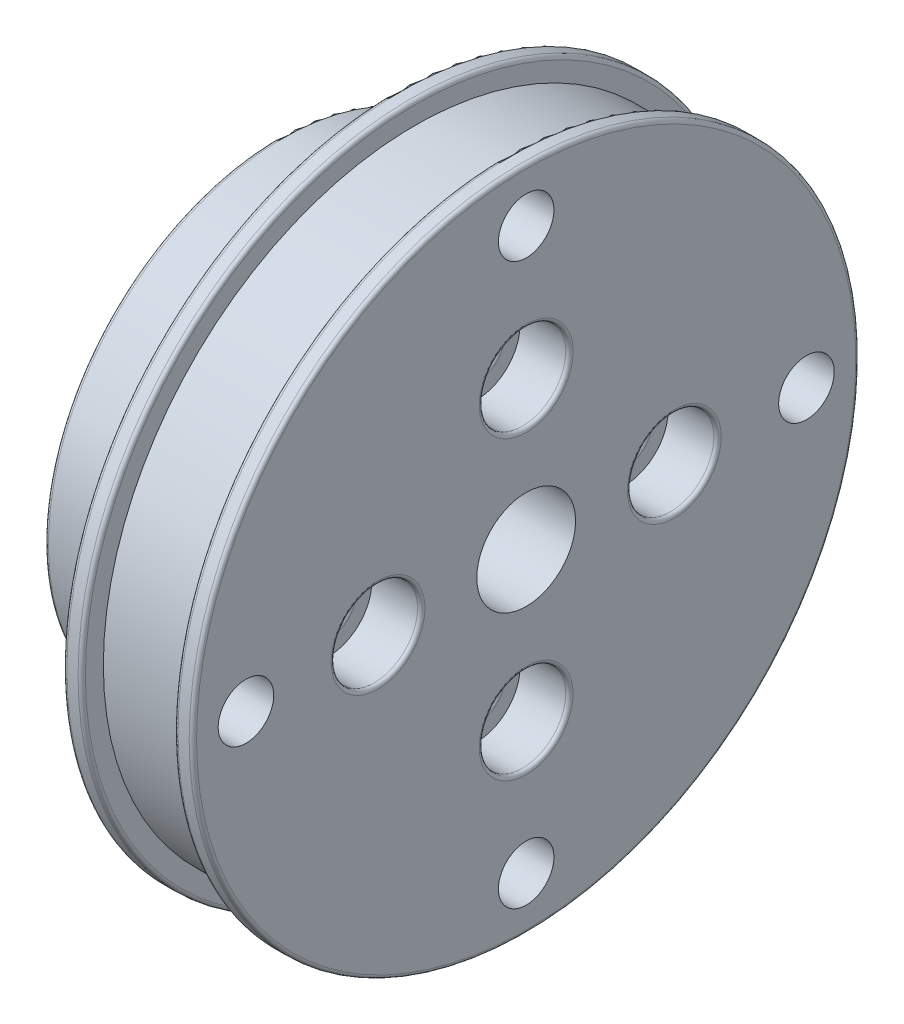
ISO-10303-21;
HEADER;
FILE_DESCRIPTION(('STEP AP214'),'2;1');
FILE_NAME('part.step','',(''),(''),'','','');
FILE_SCHEMA(('AUTOMOTIVE_DESIGN { 1 0 10303 214 1 1 1 1 }'));
ENDSEC;
DATA;
#1=APPLICATION_CONTEXT('core data for automotive mechanical design processes');
#2=APPLICATION_PROTOCOL_DEFINITION('international standard','automotive_design',2000,#1);
#3=PRODUCT_CONTEXT('',#1,'mechanical');
#4=PRODUCT('Part','Part','',(#3));
#5=PRODUCT_RELATED_PRODUCT_CATEGORY('part','',(#4));
#6=PRODUCT_DEFINITION_FORMATION('','',#4);
#7=PRODUCT_DEFINITION_CONTEXT('part definition',#1,'design');
#8=PRODUCT_DEFINITION('design','',#6,#7);
#9=PRODUCT_DEFINITION_SHAPE('','',#8);
#10=(LENGTH_UNIT() NAMED_UNIT(*) SI_UNIT(.MILLI.,.METRE.));
#11=(NAMED_UNIT(*) PLANE_ANGLE_UNIT() SI_UNIT($,.RADIAN.));
#12=(NAMED_UNIT(*) SI_UNIT($,.STERADIAN.) SOLID_ANGLE_UNIT());
#13=UNCERTAINTY_MEASURE_WITH_UNIT(LENGTH_MEASURE(1.E-05),#10,'distance_accuracy_value','');
#14=(GEOMETRIC_REPRESENTATION_CONTEXT(3) GLOBAL_UNCERTAINTY_ASSIGNED_CONTEXT((#13)) GLOBAL_UNIT_ASSIGNED_CONTEXT((#10,
#11,#12)) REPRESENTATION_CONTEXT('',''));
#15=CARTESIAN_POINT('',(0.,0.,0.));
#16=DIRECTION('',(0.,0.,1.));
#17=DIRECTION('',(1.,0.,0.));
#18=AXIS2_PLACEMENT_3D('',#15,#16,#17);
#19=CARTESIAN_POINT('',(-9.5,-12.,1.25693328198353E-13));
#20=DIRECTION('',(1.,0.,0.));
#21=DIRECTION('',(0.,0.,-1.));
#22=AXIS2_PLACEMENT_3D('',#19,#20,#21);
#23=CYLINDRICAL_SURFACE('',#22,2.);
#24=CARTESIAN_POINT('',(-9.2,-12.,1.25693328198353E-13));
#25=DIRECTION('',(1.,0.,0.));
#26=DIRECTION('',(0.,0.,-1.));
#27=AXIS2_PLACEMENT_3D('',#24,#25,#26);
#28=CIRCLE('',#27,2.);
#29=CARTESIAN_POINT('',(-9.2,-12.,-1.99999999999987));
#30=VERTEX_POINT('',#29);
#31=EDGE_CURVE('E97',#30,#30,#28,.F.);
#32=ORIENTED_EDGE('',*,*,#31,.T.);
#33=EDGE_LOOP('',(#32));
#34=FACE_BOUND('',#33,.T.);
#35=CARTESIAN_POINT('',(6.2,-12.,1.25693328198353E-13));
#36=DIRECTION('',(1.,0.,0.));
#37=DIRECTION('',(0.,0.,-1.));
#38=AXIS2_PLACEMENT_3D('',#35,#36,#37);
#39=CIRCLE('',#38,2.);
#40=CARTESIAN_POINT('',(6.2,-12.,-1.99999999999987));
#41=VERTEX_POINT('',#40);
#42=EDGE_CURVE('E100',#41,#41,#39,.T.);
#43=ORIENTED_EDGE('',*,*,#42,.T.);
#44=EDGE_LOOP('',(#43));
#45=FACE_BOUND('',#44,.T.);
#46=ADVANCED_FACE('F35',(#34,#45),#23,.F.);
#47=CARTESIAN_POINT('',(-9.5,0.,-12.));
#48=DIRECTION('',(1.,0.,0.));
#49=DIRECTION('',(0.,0.,-1.));
#50=AXIS2_PLACEMENT_3D('',#47,#48,#49);
#51=CYLINDRICAL_SURFACE('',#50,2.);
#52=CARTESIAN_POINT('',(-9.2,0.,-12.));
#53=DIRECTION('',(1.,0.,0.));
#54=DIRECTION('',(0.,0.,-1.));
#55=AXIS2_PLACEMENT_3D('',#52,#53,#54);
#56=CIRCLE('',#55,2.);
#57=CARTESIAN_POINT('',(-9.2,0.,-14.));
#58=VERTEX_POINT('',#57);
#59=EDGE_CURVE('E91',#58,#58,#56,.F.);
#60=ORIENTED_EDGE('',*,*,#59,.T.);
#61=EDGE_LOOP('',(#60));
#62=FACE_BOUND('',#61,.T.);
#63=CARTESIAN_POINT('',(6.2,0.,-12.));
#64=DIRECTION('',(1.,0.,0.));
#65=DIRECTION('',(0.,0.,-1.));
#66=AXIS2_PLACEMENT_3D('',#63,#64,#65);
#67=CIRCLE('',#66,2.);
#68=CARTESIAN_POINT('',(6.2,0.,-14.));
#69=VERTEX_POINT('',#68);
#70=EDGE_CURVE('E94',#69,#69,#67,.T.);
#71=ORIENTED_EDGE('',*,*,#70,.T.);
#72=EDGE_LOOP('',(#71));
#73=FACE_BOUND('',#72,.T.);
#74=ADVANCED_FACE('F248',(#62,#73),#51,.F.);
#75=CARTESIAN_POINT('',(-9.5,12.,0.));
#76=DIRECTION('',(1.,0.,0.));
#77=DIRECTION('',(0.,0.,-1.));
#78=AXIS2_PLACEMENT_3D('',#75,#76,#77);
#79=CYLINDRICAL_SURFACE('',#78,2.);
#80=CARTESIAN_POINT('',(-9.2,12.,0.));
#81=DIRECTION('',(1.,0.,0.));
#82=DIRECTION('',(0.,0.,-1.));
#83=AXIS2_PLACEMENT_3D('',#80,#81,#82);
#84=CIRCLE('',#83,2.);
#85=CARTESIAN_POINT('',(-9.2,12.,-2.00000000000004));
#86=VERTEX_POINT('',#85);
#87=EDGE_CURVE('E85',#86,#86,#84,.F.);
#88=ORIENTED_EDGE('',*,*,#87,.T.);
#89=EDGE_LOOP('',(#88));
#90=FACE_BOUND('',#89,.T.);
#91=CARTESIAN_POINT('',(6.2,12.,0.));
#92=DIRECTION('',(1.,0.,0.));
#93=DIRECTION('',(0.,0.,-1.));
#94=AXIS2_PLACEMENT_3D('',#91,#92,#93);
#95=CIRCLE('',#94,2.);
#96=CARTESIAN_POINT('',(6.2,12.,-2.00000000000004));
#97=VERTEX_POINT('',#96);
#98=EDGE_CURVE('E88',#97,#97,#95,.T.);
#99=ORIENTED_EDGE('',*,*,#98,.T.);
#100=EDGE_LOOP('',(#99));
#101=FACE_BOUND('',#100,.T.);
#102=ADVANCED_FACE('F254',(#90,#101),#79,.F.);
#103=CARTESIAN_POINT('',(-9.5,0.,12.));
#104=DIRECTION('',(1.,0.,0.));
#105=DIRECTION('',(0.,0.,-1.));
#106=AXIS2_PLACEMENT_3D('',#103,#104,#105);
#107=CYLINDRICAL_SURFACE('',#106,2.);
#108=CARTESIAN_POINT('',(-9.2,0.,12.));
#109=DIRECTION('',(1.,0.,0.));
#110=DIRECTION('',(0.,0.,-1.));
#111=AXIS2_PLACEMENT_3D('',#108,#109,#110);
#112=CIRCLE('',#111,2.);
#113=CARTESIAN_POINT('',(-9.2,0.,10.));
#114=VERTEX_POINT('',#113);
#115=EDGE_CURVE('E79',#114,#114,#112,.F.);
#116=ORIENTED_EDGE('',*,*,#115,.T.);
#117=EDGE_LOOP('',(#116));
#118=FACE_BOUND('',#117,.T.);
#119=CARTESIAN_POINT('',(6.2,0.,12.));
#120=DIRECTION('',(1.,0.,0.));
#121=DIRECTION('',(0.,0.,-1.));
#122=AXIS2_PLACEMENT_3D('',#119,#120,#121);
#123=CIRCLE('',#122,2.);
#124=CARTESIAN_POINT('',(6.2,0.,10.));
#125=VERTEX_POINT('',#124);
#126=EDGE_CURVE('E82',#125,#125,#123,.T.);
#127=ORIENTED_EDGE('',*,*,#126,.T.);
#128=EDGE_LOOP('',(#127));
#129=FACE_BOUND('',#128,.T.);
#130=ADVANCED_FACE('F284',(#118,#129),#107,.F.);
#131=CARTESIAN_POINT('',(0.,0.,0.));
#132=DIRECTION('',(-1.,0.,0.));
#133=DIRECTION('',(0.,0.,1.));
#134=AXIS2_PLACEMENT_3D('',#131,#132,#133);
#135=CYLINDRICAL_SURFACE('',#134,27.);
#136=CARTESIAN_POINT('',(9.3,0.,0.));
#137=DIRECTION('',(1.,0.,0.));
#138=DIRECTION('',(0.,0.,-1.));
#139=AXIS2_PLACEMENT_3D('',#136,#137,#138);
#140=CIRCLE('',#139,27.);
#141=CARTESIAN_POINT('',(9.3,0.,-27.));
#142=VERTEX_POINT('',#141);
#143=EDGE_CURVE('E136',#142,#142,#140,.T.);
#144=ORIENTED_EDGE('',*,*,#143,.T.);
#145=EDGE_LOOP('',(#144));
#146=FACE_BOUND('',#145,.T.);
#147=CARTESIAN_POINT('',(10.2,0.,0.));
#148=DIRECTION('',(-1.,0.,0.));
#149=DIRECTION('',(0.,0.,1.));
#150=AXIS2_PLACEMENT_3D('',#147,#148,#149);
#151=CIRCLE('',#150,27.);
#152=CARTESIAN_POINT('',(10.2,0.,27.));
#153=VERTEX_POINT('',#152);
#154=EDGE_CURVE('E139',#153,#153,#151,.T.);
#155=ORIENTED_EDGE('',*,*,#154,.T.);
#156=EDGE_LOOP('',(#155));
#157=FACE_BOUND('',#156,.T.);
#158=ADVANCED_FACE('F282',(#146,#157),#135,.T.);
#159=CARTESIAN_POINT('',(10.5,0.,-17.5));
#160=DIRECTION('',(-1.,0.,0.));
#161=DIRECTION('',(0.,0.,1.));
#162=AXIS2_PLACEMENT_3D('',#159,#160,#161);
#163=PLANE('',#162);
#164=CARTESIAN_POINT('',(10.5,22.7,0.));
#165=DIRECTION('',(-1.,0.,0.));
#166=DIRECTION('',(0.,0.,1.));
#167=AXIS2_PLACEMENT_3D('',#164,#165,#166);
#168=CIRCLE('',#167,2.25);
#169=CARTESIAN_POINT('',(10.5,22.7,2.25));
#170=VERTEX_POINT('',#169);
#171=EDGE_CURVE('E171',#170,#170,#168,.T.);
#172=ORIENTED_EDGE('',*,*,#171,.T.);
#173=EDGE_LOOP('',(#172));
#174=FACE_BOUND('',#173,.T.);
#175=CARTESIAN_POINT('',(10.5,6.41902997116447E-13,22.7000000000006));
#176=DIRECTION('',(-1.,0.,0.));
#177=DIRECTION('',(0.,0.,1.));
#178=AXIS2_PLACEMENT_3D('',#175,#176,#177);
#179=CIRCLE('',#178,2.2500000000005);
#180=CARTESIAN_POINT('',(10.5,6.41902997116447E-13,24.9500000000011));
#181=VERTEX_POINT('',#180);
#182=EDGE_CURVE('E194',#181,#181,#179,.T.);
#183=ORIENTED_EDGE('',*,*,#182,.T.);
#184=EDGE_LOOP('',(#183));
#185=FACE_BOUND('',#184,.T.);
#186=CARTESIAN_POINT('',(10.5,-22.7,1.28429585295255E-12));
#187=DIRECTION('',(-1.,0.,0.));
#188=DIRECTION('',(0.,0.,1.));
#189=AXIS2_PLACEMENT_3D('',#186,#187,#188);
#190=CIRCLE('',#189,2.25000000000138);
#191=CARTESIAN_POINT('',(10.5,-22.7,2.25000000000266));
#192=VERTEX_POINT('',#191);
#193=EDGE_CURVE('E188',#192,#192,#190,.T.);
#194=ORIENTED_EDGE('',*,*,#193,.T.);
#195=EDGE_LOOP('',(#194));
#196=FACE_BOUND('',#195,.T.);
#197=CARTESIAN_POINT('',(10.5,-6.44682945350512E-13,-22.6999999999994));
#198=DIRECTION('',(-1.,0.,0.));
#199=DIRECTION('',(0.,0.,1.));
#200=AXIS2_PLACEMENT_3D('',#197,#198,#199);
#201=CIRCLE('',#200,2.25000000000103);
#202=CARTESIAN_POINT('',(10.5,-6.44682945350512E-13,-20.4499999999983));
#203=VERTEX_POINT('',#202);
#204=EDGE_CURVE('E182',#203,#203,#201,.T.);
#205=ORIENTED_EDGE('',*,*,#204,.T.);
#206=EDGE_LOOP('',(#205));
#207=FACE_BOUND('',#206,.T.);
#208=CARTESIAN_POINT('',(10.5,-12.,1.25693328198353E-13));
#209=DIRECTION('',(-1.,0.,0.));
#210=DIRECTION('',(0.,0.,1.));
#211=AXIS2_PLACEMENT_3D('',#208,#209,#210);
#212=CIRCLE('',#211,3.8);
#213=CARTESIAN_POINT('',(10.5,-12.,3.80000000000013));
#214=VERTEX_POINT('',#213);
#215=EDGE_CURVE('E61',#214,#214,#212,.T.);
#216=ORIENTED_EDGE('',*,*,#215,.T.);
#217=EDGE_LOOP('',(#216));
#218=FACE_BOUND('',#217,.T.);
#219=CARTESIAN_POINT('',(10.5,0.,-12.));
#220=DIRECTION('',(-1.,0.,0.));
#221=DIRECTION('',(0.,0.,1.));
#222=AXIS2_PLACEMENT_3D('',#219,#220,#221);
#223=CIRCLE('',#222,3.8);
#224=CARTESIAN_POINT('',(10.5,0.,-8.2));
#225=VERTEX_POINT('',#224);
#226=EDGE_CURVE('E64',#225,#225,#223,.T.);
#227=ORIENTED_EDGE('',*,*,#226,.T.);
#228=EDGE_LOOP('',(#227));
#229=FACE_BOUND('',#228,.T.);
#230=CARTESIAN_POINT('',(10.5,0.,12.));
#231=DIRECTION('',(-1.,0.,0.));
#232=DIRECTION('',(0.,0.,1.));
#233=AXIS2_PLACEMENT_3D('',#230,#231,#232);
#234=CIRCLE('',#233,3.8);
#235=CARTESIAN_POINT('',(10.5,0.,15.8));
#236=VERTEX_POINT('',#235);
#237=EDGE_CURVE('E67',#236,#236,#234,.T.);
#238=ORIENTED_EDGE('',*,*,#237,.T.);
#239=EDGE_LOOP('',(#238));
#240=FACE_BOUND('',#239,.T.);
#241=CARTESIAN_POINT('',(10.5,12.,0.));
#242=DIRECTION('',(-1.,0.,0.));
#243=DIRECTION('',(0.,0.,1.));
#244=AXIS2_PLACEMENT_3D('',#241,#242,#243);
#245=CIRCLE('',#244,3.8);
#246=CARTESIAN_POINT('',(10.5,12.,3.79999999999996));
#247=VERTEX_POINT('',#246);
#248=EDGE_CURVE('E70',#247,#247,#245,.T.);
#249=ORIENTED_EDGE('',*,*,#248,.T.);
#250=EDGE_LOOP('',(#249));
#251=FACE_BOUND('',#250,.T.);
#252=CARTESIAN_POINT('',(10.5,0.,0.));
#253=DIRECTION('',(-1.,0.,0.));
#254=DIRECTION('',(0.,0.,1.));
#255=AXIS2_PLACEMENT_3D('',#252,#253,#254);
#256=CIRCLE('',#255,26.7);
#257=CARTESIAN_POINT('',(10.5,0.,26.7));
#258=VERTEX_POINT('',#257);
#259=EDGE_CURVE('E133',#258,#258,#256,.F.);
#260=ORIENTED_EDGE('',*,*,#259,.T.);
#261=EDGE_LOOP('',(#260));
#262=FACE_BOUND('',#261,.T.);
#263=CARTESIAN_POINT('',(10.5,0.,0.));
#264=DIRECTION('',(-1.,0.,0.));
#265=DIRECTION('',(0.,0.,1.));
#266=AXIS2_PLACEMENT_3D('',#263,#264,#265);
#267=CIRCLE('',#266,4.);
#268=CARTESIAN_POINT('',(10.5,0.,4.));
#269=VERTEX_POINT('',#268);
#270=EDGE_CURVE('E157',#269,#269,#267,.T.);
#271=ORIENTED_EDGE('',*,*,#270,.T.);
#272=EDGE_LOOP('',(#271));
#273=FACE_BOUND('',#272,.T.);
#274=ADVANCED_FACE('F203',(#174,#185,#196,#207,#218,#229,#240,#251,#262,#273),#163,.F.);
#275=CARTESIAN_POINT('',(0.,0.,0.));
#276=DIRECTION('',(-1.,0.,0.));
#277=DIRECTION('',(0.,0.,1.));
#278=AXIS2_PLACEMENT_3D('',#275,#276,#277);
#279=CYLINDRICAL_SURFACE('',#278,4.);
#280=CARTESIAN_POINT('',(-9.2,0.,0.));
#281=DIRECTION('',(1.,0.,0.));
#282=DIRECTION('',(0.,0.,-1.));
#283=AXIS2_PLACEMENT_3D('',#280,#281,#282);
#284=CIRCLE('',#283,4.);
#285=CARTESIAN_POINT('',(-9.2,0.,-4.));
#286=VERTEX_POINT('',#285);
#287=EDGE_CURVE('E103',#286,#286,#284,.F.);
#288=ORIENTED_EDGE('',*,*,#287,.T.);
#289=EDGE_LOOP('',(#288));
#290=FACE_BOUND('',#289,.T.);
#291=ORIENTED_EDGE('',*,*,#270,.F.);
#292=EDGE_LOOP('',(#291));
#293=FACE_BOUND('',#292,.T.);
#294=ADVANCED_FACE('F276',(#290,#293),#279,.F.);
#295=CARTESIAN_POINT('',(-9.5,0.,-4.));
#296=DIRECTION('',(1.,0.,0.));
#297=DIRECTION('',(0.,0.,-1.));
#298=AXIS2_PLACEMENT_3D('',#295,#296,#297);
#299=PLANE('',#298);
#300=CARTESIAN_POINT('',(-9.5,0.,0.));
#301=DIRECTION('',(1.,0.,0.));
#302=DIRECTION('',(0.,0.,-1.));
#303=AXIS2_PLACEMENT_3D('',#300,#301,#302);
#304=CIRCLE('',#303,18.7);
#305=CARTESIAN_POINT('',(-9.5,0.,-18.7));
#306=VERTEX_POINT('',#305);
#307=EDGE_CURVE('E106',#306,#306,#304,.F.);
#308=ORIENTED_EDGE('',*,*,#307,.T.);
#309=EDGE_LOOP('',(#308));
#310=FACE_BOUND('',#309,.T.);
#311=CARTESIAN_POINT('',(-9.5,0.,0.));
#312=DIRECTION('',(1.,0.,0.));
#313=DIRECTION('',(0.,0.,-1.));
#314=AXIS2_PLACEMENT_3D('',#311,#312,#313);
#315=CIRCLE('',#314,4.3);
#316=CARTESIAN_POINT('',(-9.5,0.,-4.3));
#317=VERTEX_POINT('',#316);
#318=EDGE_CURVE('E109',#317,#317,#315,.T.);
#319=ORIENTED_EDGE('',*,*,#318,.T.);
#320=EDGE_LOOP('',(#319));
#321=FACE_BOUND('',#320,.T.);
#322=CARTESIAN_POINT('',(-9.5,-12.,1.25693328198353E-13));
#323=DIRECTION('',(1.,0.,0.));
#324=DIRECTION('',(0.,0.,-1.));
#325=AXIS2_PLACEMENT_3D('',#322,#323,#324);
#326=CIRCLE('',#325,2.3);
#327=CARTESIAN_POINT('',(-9.5,-12.,-2.29999999999987));
#328=VERTEX_POINT('',#327);
#329=EDGE_CURVE('E112',#328,#328,#326,.T.);
#330=ORIENTED_EDGE('',*,*,#329,.T.);
#331=EDGE_LOOP('',(#330));
#332=FACE_BOUND('',#331,.T.);
#333=CARTESIAN_POINT('',(-9.5,0.,-12.));
#334=DIRECTION('',(1.,0.,0.));
#335=DIRECTION('',(0.,0.,-1.));
#336=AXIS2_PLACEMENT_3D('',#333,#334,#335);
#337=CIRCLE('',#336,2.3);
#338=CARTESIAN_POINT('',(-9.5,0.,-14.3));
#339=VERTEX_POINT('',#338);
#340=EDGE_CURVE('E115',#339,#339,#337,.T.);
#341=ORIENTED_EDGE('',*,*,#340,.T.);
#342=EDGE_LOOP('',(#341));
#343=FACE_BOUND('',#342,.T.);
#344=CARTESIAN_POINT('',(-9.5,12.,0.));
#345=DIRECTION('',(1.,0.,0.));
#346=DIRECTION('',(0.,0.,-1.));
#347=AXIS2_PLACEMENT_3D('',#344,#345,#346);
#348=CIRCLE('',#347,2.3);
#349=CARTESIAN_POINT('',(-9.5,12.,-2.30000000000004));
#350=VERTEX_POINT('',#349);
#351=EDGE_CURVE('E118',#350,#350,#348,.T.);
#352=ORIENTED_EDGE('',*,*,#351,.T.);
#353=EDGE_LOOP('',(#352));
#354=FACE_BOUND('',#353,.T.);
#355=CARTESIAN_POINT('',(-9.5,0.,12.));
#356=DIRECTION('',(1.,0.,0.));
#357=DIRECTION('',(0.,0.,-1.));
#358=AXIS2_PLACEMENT_3D('',#355,#356,#357);
#359=CIRCLE('',#358,2.3);
#360=CARTESIAN_POINT('',(-9.5,0.,9.7));
#361=VERTEX_POINT('',#360);
#362=EDGE_CURVE('E121',#361,#361,#359,.T.);
#363=ORIENTED_EDGE('',*,*,#362,.T.);
#364=EDGE_LOOP('',(#363));
#365=FACE_BOUND('',#364,.T.);
#366=ADVANCED_FACE('F272',(#310,#321,#332,#343,#354,#365),#299,.F.);
#367=CARTESIAN_POINT('',(0.,0.,0.));
#368=DIRECTION('',(-1.,0.,0.));
#369=DIRECTION('',(0.,0.,1.));
#370=AXIS2_PLACEMENT_3D('',#367,#368,#369);
#371=CYLINDRICAL_SURFACE('',#370,19.);
#372=CARTESIAN_POINT('',(-0.299999999999999,0.,0.));
#373=DIRECTION('',(1.,0.,0.));
#374=DIRECTION('',(0.,0.,-1.));
#375=AXIS2_PLACEMENT_3D('',#372,#373,#374);
#376=CIRCLE('',#375,19.);
#377=CARTESIAN_POINT('',(-0.299999999999999,0.,-19.));
#378=VERTEX_POINT('',#377);
#379=EDGE_CURVE('E127',#378,#378,#376,.F.);
#380=ORIENTED_EDGE('',*,*,#379,.T.);
#381=EDGE_LOOP('',(#380));
#382=FACE_BOUND('',#381,.T.);
#383=CARTESIAN_POINT('',(-9.2,0.,0.));
#384=DIRECTION('',(1.,0.,0.));
#385=DIRECTION('',(0.,0.,-1.));
#386=AXIS2_PLACEMENT_3D('',#383,#384,#385);
#387=CIRCLE('',#386,19.);
#388=CARTESIAN_POINT('',(-9.2,0.,-19.));
#389=VERTEX_POINT('',#388);
#390=EDGE_CURVE('E130',#389,#389,#387,.T.);
#391=ORIENTED_EDGE('',*,*,#390,.T.);
#392=EDGE_LOOP('',(#391));
#393=FACE_BOUND('',#392,.T.);
#394=ADVANCED_FACE('F217',(#382,#393),#371,.T.);
#395=CARTESIAN_POINT('',(0.,0.,-19.));
#396=DIRECTION('',(1.,0.,0.));
#397=DIRECTION('',(0.,0.,-1.));
#398=AXIS2_PLACEMENT_3D('',#395,#396,#397);
#399=PLANE('',#398);
#400=CARTESIAN_POINT('',(0.,22.7,0.));
#401=DIRECTION('',(-1.,0.,0.));
#402=DIRECTION('',(0.,0.,1.));
#403=AXIS2_PLACEMENT_3D('',#400,#401,#402);
#404=CIRCLE('',#403,2.25);
#405=CARTESIAN_POINT('',(0.,22.7,2.25));
#406=VERTEX_POINT('',#405);
#407=EDGE_CURVE('E197',#406,#406,#404,.T.);
#408=ORIENTED_EDGE('',*,*,#407,.F.);
#409=EDGE_LOOP('',(#408));
#410=FACE_BOUND('',#409,.T.);
#411=CARTESIAN_POINT('',(0.,6.41902997116447E-13,22.7000000000006));
#412=DIRECTION('',(-1.,0.,0.));
#413=DIRECTION('',(0.,0.,1.));
#414=AXIS2_PLACEMENT_3D('',#411,#412,#413);
#415=CIRCLE('',#414,2.2500000000005);
#416=CARTESIAN_POINT('',(0.,6.41902997116447E-13,24.9500000000011));
#417=VERTEX_POINT('',#416);
#418=EDGE_CURVE('E191',#417,#417,#415,.T.);
#419=ORIENTED_EDGE('',*,*,#418,.F.);
#420=EDGE_LOOP('',(#419));
#421=FACE_BOUND('',#420,.T.);
#422=CARTESIAN_POINT('',(0.,-22.7,1.28429585295255E-12));
#423=DIRECTION('',(-1.,0.,0.));
#424=DIRECTION('',(0.,0.,1.));
#425=AXIS2_PLACEMENT_3D('',#422,#423,#424);
#426=CIRCLE('',#425,2.25000000000138);
#427=CARTESIAN_POINT('',(0.,-22.7,2.25000000000266));
#428=VERTEX_POINT('',#427);
#429=EDGE_CURVE('E185',#428,#428,#426,.T.);
#430=ORIENTED_EDGE('',*,*,#429,.F.);
#431=EDGE_LOOP('',(#430));
#432=FACE_BOUND('',#431,.T.);
#433=CARTESIAN_POINT('',(0.,-6.44682945350512E-13,-22.6999999999994));
#434=DIRECTION('',(-1.,0.,0.));
#435=DIRECTION('',(0.,0.,1.));
#436=AXIS2_PLACEMENT_3D('',#433,#434,#435);
#437=CIRCLE('',#436,2.25000000000103);
#438=CARTESIAN_POINT('',(0.,-6.44682945350512E-13,-20.4499999999983));
#439=VERTEX_POINT('',#438);
#440=EDGE_CURVE('E179',#439,#439,#437,.T.);
#441=ORIENTED_EDGE('',*,*,#440,.F.);
#442=EDGE_LOOP('',(#441));
#443=FACE_BOUND('',#442,.T.);
#444=CARTESIAN_POINT('',(0.,0.,0.));
#445=DIRECTION('',(1.,0.,0.));
#446=DIRECTION('',(0.,0.,-1.));
#447=AXIS2_PLACEMENT_3D('',#444,#445,#446);
#448=CIRCLE('',#447,19.3);
#449=CARTESIAN_POINT('',(0.,0.,-19.3));
#450=VERTEX_POINT('',#449);
#451=EDGE_CURVE('E124',#450,#450,#448,.T.);
#452=ORIENTED_EDGE('',*,*,#451,.T.);
#453=EDGE_LOOP('',(#452));
#454=FACE_BOUND('',#453,.T.);
#455=CARTESIAN_POINT('',(0.,0.,0.));
#456=DIRECTION('',(1.,0.,0.));
#457=DIRECTION('',(0.,0.,-1.));
#458=AXIS2_PLACEMENT_3D('',#455,#456,#457);
#459=CIRCLE('',#458,26.7);
#460=CARTESIAN_POINT('',(0.,0.,-26.7));
#461=VERTEX_POINT('',#460);
#462=EDGE_CURVE('E154',#461,#461,#459,.F.);
#463=ORIENTED_EDGE('',*,*,#462,.T.);
#464=EDGE_LOOP('',(#463));
#465=FACE_BOUND('',#464,.T.);
#466=ADVANCED_FACE('F213',(#410,#421,#432,#443,#454,#465),#399,.F.);
#467=CARTESIAN_POINT('',(0.,0.,0.));
#468=DIRECTION('',(-1.,0.,0.));
#469=DIRECTION('',(0.,0.,1.));
#470=AXIS2_PLACEMENT_3D('',#467,#468,#469);
#471=CYLINDRICAL_SURFACE('',#470,27.);
#472=CARTESIAN_POINT('',(0.300000000000001,0.,0.));
#473=DIRECTION('',(1.,0.,0.));
#474=DIRECTION('',(0.,0.,-1.));
#475=AXIS2_PLACEMENT_3D('',#472,#473,#474);
#476=CIRCLE('',#475,27.);
#477=CARTESIAN_POINT('',(0.300000000000001,0.,-27.));
#478=VERTEX_POINT('',#477);
#479=EDGE_CURVE('E148',#478,#478,#476,.T.);
#480=ORIENTED_EDGE('',*,*,#479,.T.);
#481=EDGE_LOOP('',(#480));
#482=FACE_BOUND('',#481,.T.);
#483=CARTESIAN_POINT('',(1.2,0.,0.));
#484=DIRECTION('',(-1.,0.,0.));
#485=DIRECTION('',(0.,0.,1.));
#486=AXIS2_PLACEMENT_3D('',#483,#484,#485);
#487=CIRCLE('',#486,27.);
#488=CARTESIAN_POINT('',(1.2,0.,27.));
#489=VERTEX_POINT('',#488);
#490=EDGE_CURVE('E151',#489,#489,#487,.T.);
#491=ORIENTED_EDGE('',*,*,#490,.T.);
#492=EDGE_LOOP('',(#491));
#493=FACE_BOUND('',#492,.T.);
#494=ADVANCED_FACE('F216',(#482,#493),#471,.T.);
#495=CARTESIAN_POINT('',(1.5,0.,-27.));
#496=DIRECTION('',(-1.,0.,0.));
#497=DIRECTION('',(0.,0.,1.));
#498=AXIS2_PLACEMENT_3D('',#495,#496,#497);
#499=PLANE('',#498);
#500=CARTESIAN_POINT('',(1.5,0.,0.));
#501=DIRECTION('',(-1.,0.,0.));
#502=DIRECTION('',(0.,0.,1.));
#503=AXIS2_PLACEMENT_3D('',#500,#501,#502);
#504=CIRCLE('',#503,26.7);
#505=CARTESIAN_POINT('',(1.5,0.,26.7));
#506=VERTEX_POINT('',#505);
#507=EDGE_CURVE('E145',#506,#506,#504,.F.);
#508=ORIENTED_EDGE('',*,*,#507,.T.);
#509=EDGE_LOOP('',(#508));
#510=FACE_BOUND('',#509,.T.);
#511=CARTESIAN_POINT('',(1.5,0.,0.));
#512=DIRECTION('',(-1.,0.,0.));
#513=DIRECTION('',(0.,0.,1.));
#514=AXIS2_PLACEMENT_3D('',#511,#512,#513);
#515=CIRCLE('',#514,25.25);
#516=CARTESIAN_POINT('',(1.5,0.,25.25));
#517=VERTEX_POINT('',#516);
#518=EDGE_CURVE('E160',#517,#517,#515,.T.);
#519=ORIENTED_EDGE('',*,*,#518,.T.);
#520=EDGE_LOOP('',(#519));
#521=FACE_BOUND('',#520,.T.);
#522=ADVANCED_FACE('F262',(#510,#521),#499,.F.);
#523=CARTESIAN_POINT('',(0.,0.,0.));
#524=DIRECTION('',(-1.,0.,0.));
#525=DIRECTION('',(0.,0.,1.));
#526=AXIS2_PLACEMENT_3D('',#523,#524,#525);
#527=CYLINDRICAL_SURFACE('',#526,25.25);
#528=ORIENTED_EDGE('',*,*,#518,.F.);
#529=EDGE_LOOP('',(#528));
#530=FACE_BOUND('',#529,.T.);
#531=CARTESIAN_POINT('',(9.,0.,0.));
#532=DIRECTION('',(-1.,0.,0.));
#533=DIRECTION('',(0.,0.,1.));
#534=AXIS2_PLACEMENT_3D('',#531,#532,#533);
#535=CIRCLE('',#534,25.25);
#536=CARTESIAN_POINT('',(9.,0.,25.25));
#537=VERTEX_POINT('',#536);
#538=EDGE_CURVE('E163',#537,#537,#535,.T.);
#539=ORIENTED_EDGE('',*,*,#538,.T.);
#540=EDGE_LOOP('',(#539));
#541=FACE_BOUND('',#540,.T.);
#542=ADVANCED_FACE('F242',(#530,#541),#527,.T.);
#543=CARTESIAN_POINT('',(9.,0.,-25.25));
#544=DIRECTION('',(1.,0.,0.));
#545=DIRECTION('',(0.,0.,-1.));
#546=AXIS2_PLACEMENT_3D('',#543,#544,#545);
#547=PLANE('',#546);
#548=CARTESIAN_POINT('',(9.,0.,0.));
#549=DIRECTION('',(1.,0.,0.));
#550=DIRECTION('',(0.,0.,-1.));
#551=AXIS2_PLACEMENT_3D('',#548,#549,#550);
#552=CIRCLE('',#551,26.7);
#553=CARTESIAN_POINT('',(9.,0.,-26.7));
#554=VERTEX_POINT('',#553);
#555=EDGE_CURVE('E142',#554,#554,#552,.F.);
#556=ORIENTED_EDGE('',*,*,#555,.T.);
#557=EDGE_LOOP('',(#556));
#558=FACE_BOUND('',#557,.T.);
#559=ORIENTED_EDGE('',*,*,#538,.F.);
#560=EDGE_LOOP('',(#559));
#561=FACE_BOUND('',#560,.T.);
#562=ADVANCED_FACE('F232',(#558,#561),#547,.F.);
#563=CARTESIAN_POINT('',(0.300000000000001,0.,0.));
#564=DIRECTION('',(1.,0.,0.));
#565=DIRECTION('',(0.,0.,-1.));
#566=AXIS2_PLACEMENT_3D('',#563,#564,#565);
#567=TOROIDAL_SURFACE('',#566,26.7,0.3);
#568=ORIENTED_EDGE('',*,*,#479,.F.);
#569=EDGE_LOOP('',(#568));
#570=FACE_BOUND('',#569,.T.);
#571=ORIENTED_EDGE('',*,*,#462,.F.);
#572=EDGE_LOOP('',(#571));
#573=FACE_BOUND('',#572,.T.);
#574=ADVANCED_FACE('F229',(#570,#573),#567,.T.);
#575=CARTESIAN_POINT('',(1.2,0.,0.));
#576=DIRECTION('',(-1.,0.,0.));
#577=DIRECTION('',(0.,0.,1.));
#578=AXIS2_PLACEMENT_3D('',#575,#576,#577);
#579=TOROIDAL_SURFACE('',#578,26.7,0.3);
#580=ORIENTED_EDGE('',*,*,#507,.F.);
#581=EDGE_LOOP('',(#580));
#582=FACE_BOUND('',#581,.T.);
#583=ORIENTED_EDGE('',*,*,#490,.F.);
#584=EDGE_LOOP('',(#583));
#585=FACE_BOUND('',#584,.T.);
#586=ADVANCED_FACE('F231',(#582,#585),#579,.T.);
#587=CARTESIAN_POINT('',(9.3,0.,0.));
#588=DIRECTION('',(1.,0.,0.));
#589=DIRECTION('',(0.,0.,-1.));
#590=AXIS2_PLACEMENT_3D('',#587,#588,#589);
#591=TOROIDAL_SURFACE('',#590,26.7,0.3);
#592=ORIENTED_EDGE('',*,*,#143,.F.);
#593=EDGE_LOOP('',(#592));
#594=FACE_BOUND('',#593,.T.);
#595=ORIENTED_EDGE('',*,*,#555,.F.);
#596=EDGE_LOOP('',(#595));
#597=FACE_BOUND('',#596,.T.);
#598=ADVANCED_FACE('F239',(#594,#597),#591,.T.);
#599=CARTESIAN_POINT('',(10.2,0.,0.));
#600=DIRECTION('',(-1.,0.,0.));
#601=DIRECTION('',(0.,0.,1.));
#602=AXIS2_PLACEMENT_3D('',#599,#600,#601);
#603=TOROIDAL_SURFACE('',#602,26.7,0.3);
#604=ORIENTED_EDGE('',*,*,#259,.F.);
#605=EDGE_LOOP('',(#604));
#606=FACE_BOUND('',#605,.T.);
#607=ORIENTED_EDGE('',*,*,#154,.F.);
#608=EDGE_LOOP('',(#607));
#609=FACE_BOUND('',#608,.T.);
#610=ADVANCED_FACE('F295',(#606,#609),#603,.T.);
#611=CARTESIAN_POINT('',(6.5,0.,12.));
#612=DIRECTION('',(1.,0.,0.));
#613=DIRECTION('',(0.,0.,-1.));
#614=AXIS2_PLACEMENT_3D('',#611,#612,#613);
#615=PLANE('',#614);
#616=CARTESIAN_POINT('',(6.5,0.,12.));
#617=DIRECTION('',(1.,0.,0.));
#618=DIRECTION('',(0.,0.,-1.));
#619=AXIS2_PLACEMENT_3D('',#616,#617,#618);
#620=CIRCLE('',#619,2.3);
#621=CARTESIAN_POINT('',(6.5,0.,9.7));
#622=VERTEX_POINT('',#621);
#623=EDGE_CURVE('E50',#622,#622,#620,.F.);
#624=ORIENTED_EDGE('',*,*,#623,.T.);
#625=EDGE_LOOP('',(#624));
#626=FACE_BOUND('',#625,.T.);
#627=CARTESIAN_POINT('',(6.5,0.,12.));
#628=DIRECTION('',(1.,0.,0.));
#629=DIRECTION('',(0.,0.,-1.));
#630=AXIS2_PLACEMENT_3D('',#627,#628,#629);
#631=CIRCLE('',#630,3.5);
#632=CARTESIAN_POINT('',(6.5,0.,8.5));
#633=VERTEX_POINT('',#632);
#634=EDGE_CURVE('E166',#633,#633,#631,.T.);
#635=ORIENTED_EDGE('',*,*,#634,.T.);
#636=EDGE_LOOP('',(#635));
#637=FACE_BOUND('',#636,.T.);
#638=ADVANCED_FACE('F297',(#626,#637),#615,.T.);
#639=CARTESIAN_POINT('',(6.5,0.,12.));
#640=DIRECTION('',(1.,0.,0.));
#641=DIRECTION('',(0.,0.,-1.));
#642=AXIS2_PLACEMENT_3D('',#639,#640,#641);
#643=CYLINDRICAL_SURFACE('',#642,3.5);
#644=CARTESIAN_POINT('',(10.2,0.,12.));
#645=DIRECTION('',(-1.,0.,0.));
#646=DIRECTION('',(0.,0.,1.));
#647=AXIS2_PLACEMENT_3D('',#644,#645,#646);
#648=CIRCLE('',#647,3.5);
#649=CARTESIAN_POINT('',(10.2,0.,15.5));
#650=VERTEX_POINT('',#649);
#651=EDGE_CURVE('E46',#650,#650,#648,.F.);
#652=ORIENTED_EDGE('',*,*,#651,.T.);
#653=EDGE_LOOP('',(#652));
#654=FACE_BOUND('',#653,.T.);
#655=ORIENTED_EDGE('',*,*,#634,.F.);
#656=EDGE_LOOP('',(#655));
#657=FACE_BOUND('',#656,.T.);
#658=ADVANCED_FACE('F304',(#654,#657),#643,.F.);
#659=CARTESIAN_POINT('',(6.5,12.,0.));
#660=DIRECTION('',(1.,0.,0.));
#661=DIRECTION('',(0.,0.,-1.));
#662=AXIS2_PLACEMENT_3D('',#659,#660,#661);
#663=PLANE('',#662);
#664=CARTESIAN_POINT('',(6.5,12.,0.));
#665=DIRECTION('',(1.,0.,0.));
#666=DIRECTION('',(0.,0.,-1.));
#667=AXIS2_PLACEMENT_3D('',#664,#665,#666);
#668=CIRCLE('',#667,2.3);
#669=CARTESIAN_POINT('',(6.5,12.,-2.30000000000004));
#670=VERTEX_POINT('',#669);
#671=EDGE_CURVE('E42',#670,#670,#668,.F.);
#672=ORIENTED_EDGE('',*,*,#671,.T.);
#673=EDGE_LOOP('',(#672));
#674=FACE_BOUND('',#673,.T.);
#675=CARTESIAN_POINT('',(6.5,12.,0.));
#676=DIRECTION('',(1.,0.,0.));
#677=DIRECTION('',(0.,0.,-1.));
#678=AXIS2_PLACEMENT_3D('',#675,#676,#677);
#679=CIRCLE('',#678,3.5);
#680=CARTESIAN_POINT('',(6.5,12.,-3.50000000000004));
#681=VERTEX_POINT('',#680);
#682=EDGE_CURVE('E167',#681,#681,#679,.T.);
#683=ORIENTED_EDGE('',*,*,#682,.T.);
#684=EDGE_LOOP('',(#683));
#685=FACE_BOUND('',#684,.T.);
#686=ADVANCED_FACE('F379',(#674,#685),#663,.T.);
#687=CARTESIAN_POINT('',(6.5,12.,0.));
#688=DIRECTION('',(1.,0.,0.));
#689=DIRECTION('',(0.,0.,-1.));
#690=AXIS2_PLACEMENT_3D('',#687,#688,#689);
#691=CYLINDRICAL_SURFACE('',#690,3.5);
#692=CARTESIAN_POINT('',(10.2,12.,0.));
#693=DIRECTION('',(-1.,0.,0.));
#694=DIRECTION('',(0.,0.,1.));
#695=AXIS2_PLACEMENT_3D('',#692,#693,#694);
#696=CIRCLE('',#695,3.5);
#697=CARTESIAN_POINT('',(10.2,12.,3.49999999999996));
#698=VERTEX_POINT('',#697);
#699=EDGE_CURVE('E10',#698,#698,#696,.F.);
#700=ORIENTED_EDGE('',*,*,#699,.T.);
#701=EDGE_LOOP('',(#700));
#702=FACE_BOUND('',#701,.T.);
#703=ORIENTED_EDGE('',*,*,#682,.F.);
#704=EDGE_LOOP('',(#703));
#705=FACE_BOUND('',#704,.T.);
#706=ADVANCED_FACE('F382',(#702,#705),#691,.F.);
#707=CARTESIAN_POINT('',(6.5,0.,-12.));
#708=DIRECTION('',(1.,0.,0.));
#709=DIRECTION('',(0.,0.,-1.));
#710=AXIS2_PLACEMENT_3D('',#707,#708,#709);
#711=PLANE('',#710);
#712=CARTESIAN_POINT('',(6.5,0.,-12.));
#713=DIRECTION('',(1.,0.,0.));
#714=DIRECTION('',(0.,0.,-1.));
#715=AXIS2_PLACEMENT_3D('',#712,#713,#714);
#716=CIRCLE('',#715,2.3);
#717=CARTESIAN_POINT('',(6.5,0.,-14.3));
#718=VERTEX_POINT('',#717);
#719=EDGE_CURVE('E58',#718,#718,#716,.F.);
#720=ORIENTED_EDGE('',*,*,#719,.T.);
#721=EDGE_LOOP('',(#720));
#722=FACE_BOUND('',#721,.T.);
#723=CARTESIAN_POINT('',(6.5,0.,-12.));
#724=DIRECTION('',(1.,0.,0.));
#725=DIRECTION('',(0.,0.,-1.));
#726=AXIS2_PLACEMENT_3D('',#723,#724,#725);
#727=CIRCLE('',#726,3.5);
#728=CARTESIAN_POINT('',(6.5,0.,-15.5));
#729=VERTEX_POINT('',#728);
#730=EDGE_CURVE('E170',#729,#729,#727,.T.);
#731=ORIENTED_EDGE('',*,*,#730,.T.);
#732=EDGE_LOOP('',(#731));
#733=FACE_BOUND('',#732,.T.);
#734=ADVANCED_FACE('F385',(#722,#733),#711,.T.);
#735=CARTESIAN_POINT('',(6.5,0.,-12.));
#736=DIRECTION('',(1.,0.,0.));
#737=DIRECTION('',(0.,0.,-1.));
#738=AXIS2_PLACEMENT_3D('',#735,#736,#737);
#739=CYLINDRICAL_SURFACE('',#738,3.5);
#740=CARTESIAN_POINT('',(10.2,0.,-12.));
#741=DIRECTION('',(-1.,0.,0.));
#742=DIRECTION('',(0.,0.,1.));
#743=AXIS2_PLACEMENT_3D('',#740,#741,#742);
#744=CIRCLE('',#743,3.5);
#745=CARTESIAN_POINT('',(10.2,0.,-8.5));
#746=VERTEX_POINT('',#745);
#747=EDGE_CURVE('E55',#746,#746,#744,.F.);
#748=ORIENTED_EDGE('',*,*,#747,.T.);
#749=EDGE_LOOP('',(#748));
#750=FACE_BOUND('',#749,.T.);
#751=ORIENTED_EDGE('',*,*,#730,.F.);
#752=EDGE_LOOP('',(#751));
#753=FACE_BOUND('',#752,.T.);
#754=ADVANCED_FACE('F388',(#750,#753),#739,.F.);
#755=CARTESIAN_POINT('',(6.5,-12.,1.25693328198353E-13));
#756=DIRECTION('',(1.,0.,0.));
#757=DIRECTION('',(0.,0.,-1.));
#758=AXIS2_PLACEMENT_3D('',#755,#756,#757);
#759=PLANE('',#758);
#760=CARTESIAN_POINT('',(6.5,-12.,1.25693328198353E-13));
#761=DIRECTION('',(1.,0.,0.));
#762=DIRECTION('',(0.,0.,-1.));
#763=AXIS2_PLACEMENT_3D('',#760,#761,#762);
#764=CIRCLE('',#763,2.3);
#765=CARTESIAN_POINT('',(6.5,-12.,-2.29999999999987));
#766=VERTEX_POINT('',#765);
#767=EDGE_CURVE('E76',#766,#766,#764,.F.);
#768=ORIENTED_EDGE('',*,*,#767,.T.);
#769=EDGE_LOOP('',(#768));
#770=FACE_BOUND('',#769,.T.);
#771=CARTESIAN_POINT('',(6.5,-12.,1.25693328198353E-13));
#772=DIRECTION('',(1.,0.,0.));
#773=DIRECTION('',(0.,0.,-1.));
#774=AXIS2_PLACEMENT_3D('',#771,#772,#773);
#775=CIRCLE('',#774,3.5);
#776=CARTESIAN_POINT('',(6.5,-12.,-3.49999999999987));
#777=VERTEX_POINT('',#776);
#778=EDGE_CURVE('E174',#777,#777,#775,.T.);
#779=ORIENTED_EDGE('',*,*,#778,.T.);
#780=EDGE_LOOP('',(#779));
#781=FACE_BOUND('',#780,.T.);
#782=ADVANCED_FACE('F392',(#770,#781),#759,.T.);
#783=CARTESIAN_POINT('',(6.5,-12.,1.25693328198353E-13));
#784=DIRECTION('',(1.,0.,0.));
#785=DIRECTION('',(0.,0.,-1.));
#786=AXIS2_PLACEMENT_3D('',#783,#784,#785);
#787=CYLINDRICAL_SURFACE('',#786,3.5);
#788=CARTESIAN_POINT('',(10.2,-12.,1.25693328198353E-13));
#789=DIRECTION('',(-1.,0.,0.));
#790=DIRECTION('',(0.,0.,1.));
#791=AXIS2_PLACEMENT_3D('',#788,#789,#790);
#792=CIRCLE('',#791,3.5);
#793=CARTESIAN_POINT('',(10.2,-12.,3.50000000000013));
#794=VERTEX_POINT('',#793);
#795=EDGE_CURVE('E73',#794,#794,#792,.F.);
#796=ORIENTED_EDGE('',*,*,#795,.T.);
#797=EDGE_LOOP('',(#796));
#798=FACE_BOUND('',#797,.T.);
#799=ORIENTED_EDGE('',*,*,#778,.F.);
#800=EDGE_LOOP('',(#799));
#801=FACE_BOUND('',#800,.T.);
#802=ADVANCED_FACE('F315',(#798,#801),#787,.F.);
#803=CARTESIAN_POINT('',(-0.299999999999999,0.,0.));
#804=DIRECTION('',(1.,0.,0.));
#805=DIRECTION('',(0.,0.,-1.));
#806=AXIS2_PLACEMENT_3D('',#803,#804,#805);
#807=TOROIDAL_SURFACE('',#806,19.3,0.3);
#808=ORIENTED_EDGE('',*,*,#451,.F.);
#809=EDGE_LOOP('',(#808));
#810=FACE_BOUND('',#809,.T.);
#811=ORIENTED_EDGE('',*,*,#379,.F.);
#812=EDGE_LOOP('',(#811));
#813=FACE_BOUND('',#812,.T.);
#814=ADVANCED_FACE('F311',(#810,#813),#807,.F.);
#815=CARTESIAN_POINT('',(-9.2,0.,0.));
#816=DIRECTION('',(1.,0.,0.));
#817=DIRECTION('',(0.,0.,-1.));
#818=AXIS2_PLACEMENT_3D('',#815,#816,#817);
#819=TOROIDAL_SURFACE('',#818,18.7,0.3);
#820=ORIENTED_EDGE('',*,*,#390,.F.);
#821=EDGE_LOOP('',(#820));
#822=FACE_BOUND('',#821,.T.);
#823=ORIENTED_EDGE('',*,*,#307,.F.);
#824=EDGE_LOOP('',(#823));
#825=FACE_BOUND('',#824,.T.);
#826=ADVANCED_FACE('F314',(#822,#825),#819,.T.);
#827=CARTESIAN_POINT('',(-9.2,0.,0.));
#828=DIRECTION('',(1.,0.,0.));
#829=DIRECTION('',(0.,0.,-1.));
#830=AXIS2_PLACEMENT_3D('',#827,#828,#829);
#831=TOROIDAL_SURFACE('',#830,4.3,0.3);
#832=ORIENTED_EDGE('',*,*,#318,.F.);
#833=EDGE_LOOP('',(#832));
#834=FACE_BOUND('',#833,.T.);
#835=ORIENTED_EDGE('',*,*,#287,.F.);
#836=EDGE_LOOP('',(#835));
#837=FACE_BOUND('',#836,.T.);
#838=ADVANCED_FACE('F319',(#834,#837),#831,.T.);
#839=CARTESIAN_POINT('',(-9.2,-12.,1.25693328198353E-13));
#840=DIRECTION('',(1.,0.,0.));
#841=DIRECTION('',(0.,0.,-1.));
#842=AXIS2_PLACEMENT_3D('',#839,#840,#841);
#843=TOROIDAL_SURFACE('',#842,2.3,0.3);
#844=ORIENTED_EDGE('',*,*,#31,.F.);
#845=EDGE_LOOP('',(#844));
#846=FACE_BOUND('',#845,.T.);
#847=ORIENTED_EDGE('',*,*,#329,.F.);
#848=EDGE_LOOP('',(#847));
#849=FACE_BOUND('',#848,.T.);
#850=ADVANCED_FACE('F323',(#846,#849),#843,.T.);
#851=CARTESIAN_POINT('',(-9.2,0.,-12.));
#852=DIRECTION('',(1.,0.,0.));
#853=DIRECTION('',(0.,0.,-1.));
#854=AXIS2_PLACEMENT_3D('',#851,#852,#853);
#855=TOROIDAL_SURFACE('',#854,2.3,0.3);
#856=ORIENTED_EDGE('',*,*,#59,.F.);
#857=EDGE_LOOP('',(#856));
#858=FACE_BOUND('',#857,.T.);
#859=ORIENTED_EDGE('',*,*,#340,.F.);
#860=EDGE_LOOP('',(#859));
#861=FACE_BOUND('',#860,.T.);
#862=ADVANCED_FACE('F327',(#858,#861),#855,.T.);
#863=CARTESIAN_POINT('',(-9.2,12.,0.));
#864=DIRECTION('',(1.,0.,0.));
#865=DIRECTION('',(0.,0.,-1.));
#866=AXIS2_PLACEMENT_3D('',#863,#864,#865);
#867=TOROIDAL_SURFACE('',#866,2.3,0.3);
#868=ORIENTED_EDGE('',*,*,#87,.F.);
#869=EDGE_LOOP('',(#868));
#870=FACE_BOUND('',#869,.T.);
#871=ORIENTED_EDGE('',*,*,#351,.F.);
#872=EDGE_LOOP('',(#871));
#873=FACE_BOUND('',#872,.T.);
#874=ADVANCED_FACE('F331',(#870,#873),#867,.T.);
#875=CARTESIAN_POINT('',(-9.2,0.,12.));
#876=DIRECTION('',(1.,0.,0.));
#877=DIRECTION('',(0.,0.,-1.));
#878=AXIS2_PLACEMENT_3D('',#875,#876,#877);
#879=TOROIDAL_SURFACE('',#878,2.3,0.3);
#880=ORIENTED_EDGE('',*,*,#115,.F.);
#881=EDGE_LOOP('',(#880));
#882=FACE_BOUND('',#881,.T.);
#883=ORIENTED_EDGE('',*,*,#362,.F.);
#884=EDGE_LOOP('',(#883));
#885=FACE_BOUND('',#884,.T.);
#886=ADVANCED_FACE('F335',(#882,#885),#879,.T.);
#887=CARTESIAN_POINT('',(6.2,-12.,1.25693328198353E-13));
#888=DIRECTION('',(1.,0.,0.));
#889=DIRECTION('',(0.,0.,-1.));
#890=AXIS2_PLACEMENT_3D('',#887,#888,#889);
#891=TOROIDAL_SURFACE('',#890,2.3,0.3);
#892=ORIENTED_EDGE('',*,*,#42,.F.);
#893=EDGE_LOOP('',(#892));
#894=FACE_BOUND('',#893,.T.);
#895=ORIENTED_EDGE('',*,*,#767,.F.);
#896=EDGE_LOOP('',(#895));
#897=FACE_BOUND('',#896,.T.);
#898=ADVANCED_FACE('F339',(#894,#897),#891,.T.);
#899=CARTESIAN_POINT('',(10.2,-12.,1.25693328198353E-13));
#900=DIRECTION('',(-1.,0.,0.));
#901=DIRECTION('',(0.,0.,1.));
#902=AXIS2_PLACEMENT_3D('',#899,#900,#901);
#903=TOROIDAL_SURFACE('',#902,3.8,0.3);
#904=ORIENTED_EDGE('',*,*,#215,.F.);
#905=EDGE_LOOP('',(#904));
#906=FACE_BOUND('',#905,.T.);
#907=ORIENTED_EDGE('',*,*,#795,.F.);
#908=EDGE_LOOP('',(#907));
#909=FACE_BOUND('',#908,.T.);
#910=ADVANCED_FACE('F343',(#906,#909),#903,.T.);
#911=CARTESIAN_POINT('',(6.2,0.,-12.));
#912=DIRECTION('',(1.,0.,0.));
#913=DIRECTION('',(0.,0.,-1.));
#914=AXIS2_PLACEMENT_3D('',#911,#912,#913);
#915=TOROIDAL_SURFACE('',#914,2.3,0.3);
#916=ORIENTED_EDGE('',*,*,#70,.F.);
#917=EDGE_LOOP('',(#916));
#918=FACE_BOUND('',#917,.T.);
#919=ORIENTED_EDGE('',*,*,#719,.F.);
#920=EDGE_LOOP('',(#919));
#921=FACE_BOUND('',#920,.T.);
#922=ADVANCED_FACE('F347',(#918,#921),#915,.T.);
#923=CARTESIAN_POINT('',(10.2,0.,-12.));
#924=DIRECTION('',(-1.,0.,0.));
#925=DIRECTION('',(0.,0.,1.));
#926=AXIS2_PLACEMENT_3D('',#923,#924,#925);
#927=TOROIDAL_SURFACE('',#926,3.8,0.3);
#928=ORIENTED_EDGE('',*,*,#226,.F.);
#929=EDGE_LOOP('',(#928));
#930=FACE_BOUND('',#929,.T.);
#931=ORIENTED_EDGE('',*,*,#747,.F.);
#932=EDGE_LOOP('',(#931));
#933=FACE_BOUND('',#932,.T.);
#934=ADVANCED_FACE('F351',(#930,#933),#927,.T.);
#935=CARTESIAN_POINT('',(6.2,0.,12.));
#936=DIRECTION('',(1.,0.,0.));
#937=DIRECTION('',(0.,0.,-1.));
#938=AXIS2_PLACEMENT_3D('',#935,#936,#937);
#939=TOROIDAL_SURFACE('',#938,2.3,0.3);
#940=ORIENTED_EDGE('',*,*,#126,.F.);
#941=EDGE_LOOP('',(#940));
#942=FACE_BOUND('',#941,.T.);
#943=ORIENTED_EDGE('',*,*,#623,.F.);
#944=EDGE_LOOP('',(#943));
#945=FACE_BOUND('',#944,.T.);
#946=ADVANCED_FACE('F355',(#942,#945),#939,.T.);
#947=CARTESIAN_POINT('',(10.2,0.,12.));
#948=DIRECTION('',(-1.,0.,0.));
#949=DIRECTION('',(0.,0.,1.));
#950=AXIS2_PLACEMENT_3D('',#947,#948,#949);
#951=TOROIDAL_SURFACE('',#950,3.8,0.3);
#952=ORIENTED_EDGE('',*,*,#237,.F.);
#953=EDGE_LOOP('',(#952));
#954=FACE_BOUND('',#953,.T.);
#955=ORIENTED_EDGE('',*,*,#651,.F.);
#956=EDGE_LOOP('',(#955));
#957=FACE_BOUND('',#956,.T.);
#958=ADVANCED_FACE('F359',(#954,#957),#951,.T.);
#959=CARTESIAN_POINT('',(6.2,12.,0.));
#960=DIRECTION('',(1.,0.,0.));
#961=DIRECTION('',(0.,0.,-1.));
#962=AXIS2_PLACEMENT_3D('',#959,#960,#961);
#963=TOROIDAL_SURFACE('',#962,2.3,0.3);
#964=ORIENTED_EDGE('',*,*,#98,.F.);
#965=EDGE_LOOP('',(#964));
#966=FACE_BOUND('',#965,.T.);
#967=ORIENTED_EDGE('',*,*,#671,.F.);
#968=EDGE_LOOP('',(#967));
#969=FACE_BOUND('',#968,.T.);
#970=ADVANCED_FACE('F362',(#966,#969),#963,.T.);
#971=CARTESIAN_POINT('',(10.2,12.,0.));
#972=DIRECTION('',(-1.,0.,0.));
#973=DIRECTION('',(0.,0.,1.));
#974=AXIS2_PLACEMENT_3D('',#971,#972,#973);
#975=TOROIDAL_SURFACE('',#974,3.8,0.3);
#976=ORIENTED_EDGE('',*,*,#248,.F.);
#977=EDGE_LOOP('',(#976));
#978=FACE_BOUND('',#977,.T.);
#979=ORIENTED_EDGE('',*,*,#699,.F.);
#980=EDGE_LOOP('',(#979));
#981=FACE_BOUND('',#980,.T.);
#982=ADVANCED_FACE('F37',(#978,#981),#975,.T.);
#983=CARTESIAN_POINT('',(10.5,-6.44682945350512E-13,-22.6999999999994));
#984=DIRECTION('',(-1.,0.,0.));
#985=DIRECTION('',(0.,0.,1.));
#986=AXIS2_PLACEMENT_3D('',#983,#984,#985);
#987=CYLINDRICAL_SURFACE('',#986,2.25000000000103);
#988=ORIENTED_EDGE('',*,*,#204,.F.);
#989=EDGE_LOOP('',(#988));
#990=FACE_BOUND('',#989,.T.);
#991=ORIENTED_EDGE('',*,*,#440,.T.);
#992=EDGE_LOOP('',(#991));
#993=FACE_BOUND('',#992,.T.);
#994=ADVANCED_FACE('F369',(#990,#993),#987,.F.);
#995=CARTESIAN_POINT('',(10.5,-22.7,1.28429585295255E-12));
#996=DIRECTION('',(-1.,0.,0.));
#997=DIRECTION('',(0.,0.,1.));
#998=AXIS2_PLACEMENT_3D('',#995,#996,#997);
#999=CYLINDRICAL_SURFACE('',#998,2.25000000000138);
#1000=ORIENTED_EDGE('',*,*,#193,.F.);
#1001=EDGE_LOOP('',(#1000));
#1002=FACE_BOUND('',#1001,.T.);
#1003=ORIENTED_EDGE('',*,*,#429,.T.);
#1004=EDGE_LOOP('',(#1003));
#1005=FACE_BOUND('',#1004,.T.);
#1006=ADVANCED_FACE('F405',(#1002,#1005),#999,.F.);
#1007=CARTESIAN_POINT('',(10.5,6.41902997116447E-13,22.7000000000006));
#1008=DIRECTION('',(-1.,0.,0.));
#1009=DIRECTION('',(0.,0.,1.));
#1010=AXIS2_PLACEMENT_3D('',#1007,#1008,#1009);
#1011=CYLINDRICAL_SURFACE('',#1010,2.2500000000005);
#1012=ORIENTED_EDGE('',*,*,#182,.F.);
#1013=EDGE_LOOP('',(#1012));
#1014=FACE_BOUND('',#1013,.T.);
#1015=ORIENTED_EDGE('',*,*,#418,.T.);
#1016=EDGE_LOOP('',(#1015));
#1017=FACE_BOUND('',#1016,.T.);
#1018=ADVANCED_FACE('F209',(#1014,#1017),#1011,.F.);
#1019=CARTESIAN_POINT('',(10.5,22.7,0.));
#1020=DIRECTION('',(-1.,0.,0.));
#1021=DIRECTION('',(0.,0.,1.));
#1022=AXIS2_PLACEMENT_3D('',#1019,#1020,#1021);
#1023=CYLINDRICAL_SURFACE('',#1022,2.25);
#1024=ORIENTED_EDGE('',*,*,#171,.F.);
#1025=EDGE_LOOP('',(#1024));
#1026=FACE_BOUND('',#1025,.T.);
#1027=ORIENTED_EDGE('',*,*,#407,.T.);
#1028=EDGE_LOOP('',(#1027));
#1029=FACE_BOUND('',#1028,.T.);
#1030=ADVANCED_FACE('F206',(#1026,#1029),#1023,.F.);
#1031=CLOSED_SHELL('',(#46,#74,#102,#130,#158,#274,#294,#366,#394,#466,#494,#522,#542,#562,#574,
#586,#598,#610,#638,#658,#686,#706,#734,#754,#782,#802,#814,#826,#838,#850,#862,#874,#886,#898,
#910,#922,#934,#946,#958,#970,#982,#994,#1006,#1018,#1030));
#1032=MANIFOLD_SOLID_BREP('B2',#1031);
#1033=ADVANCED_BREP_SHAPE_REPRESENTATION('',(#18,#1032),#14);
#1034=SHAPE_DEFINITION_REPRESENTATION(#9,#1033);
ENDSEC;
END-ISO-10303-21;
